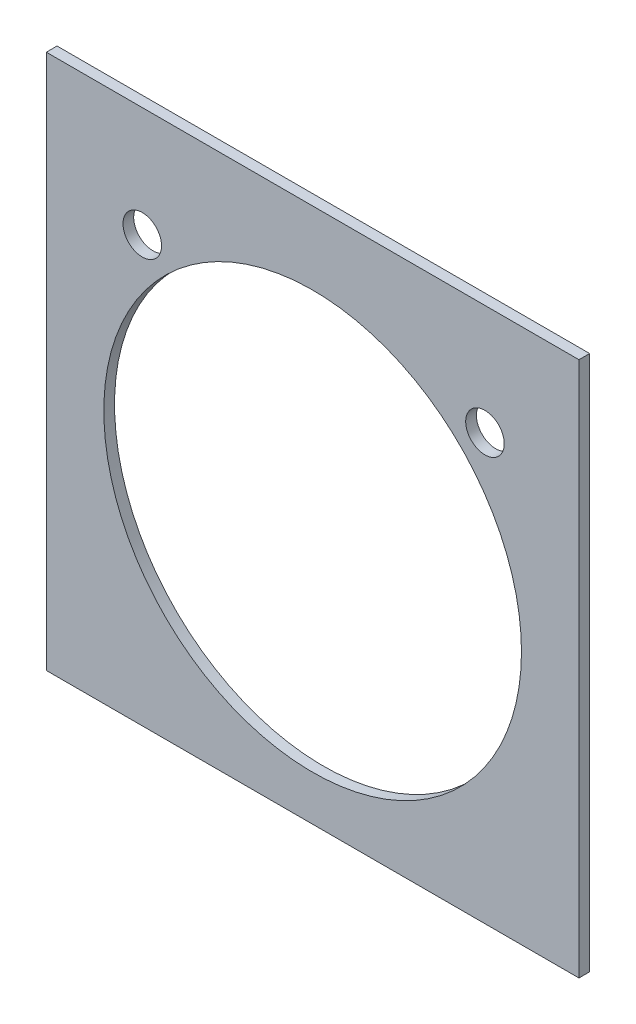
ISO-10303-21;
HEADER;
FILE_DESCRIPTION(('STEP AP214'),'2;1');
FILE_NAME('part.step','',(''),(''),'','','');
FILE_SCHEMA(('AUTOMOTIVE_DESIGN { 1 0 10303 214 1 1 1 1 }'));
ENDSEC;
DATA;
#1=APPLICATION_CONTEXT('core data for automotive mechanical design processes');
#2=APPLICATION_PROTOCOL_DEFINITION('international standard','automotive_design',2000,#1);
#3=PRODUCT_CONTEXT('',#1,'mechanical');
#4=PRODUCT('Part','Part','',(#3));
#5=PRODUCT_RELATED_PRODUCT_CATEGORY('part','',(#4));
#6=PRODUCT_DEFINITION_FORMATION('','',#4);
#7=PRODUCT_DEFINITION_CONTEXT('part definition',#1,'design');
#8=PRODUCT_DEFINITION('design','',#6,#7);
#9=PRODUCT_DEFINITION_SHAPE('','',#8);
#10=(LENGTH_UNIT() NAMED_UNIT(*) SI_UNIT(.MILLI.,.METRE.));
#11=(NAMED_UNIT(*) PLANE_ANGLE_UNIT() SI_UNIT($,.RADIAN.));
#12=(NAMED_UNIT(*) SI_UNIT($,.STERADIAN.) SOLID_ANGLE_UNIT());
#13=UNCERTAINTY_MEASURE_WITH_UNIT(LENGTH_MEASURE(1.E-05),#10,'distance_accuracy_value','');
#14=(GEOMETRIC_REPRESENTATION_CONTEXT(3) GLOBAL_UNCERTAINTY_ASSIGNED_CONTEXT((#13)) GLOBAL_UNIT_ASSIGNED_CONTEXT((#10,
#11,#12)) REPRESENTATION_CONTEXT('',''));
#15=CARTESIAN_POINT('',(0.,0.,0.));
#16=DIRECTION('',(0.,0.,1.));
#17=DIRECTION('',(1.,0.,0.));
#18=AXIS2_PLACEMENT_3D('',#15,#16,#17);
#19=CARTESIAN_POINT('',(24.8681898066784,25.,1.));
#20=DIRECTION('',(-1.,0.,0.));
#21=DIRECTION('',(0.,0.,1.));
#22=AXIS2_PLACEMENT_3D('',#19,#20,#21);
#23=PLANE('',#22);
#24=DIRECTION('',(0.,1.,0.));
#25=VECTOR('',#24,1.);
#26=CARTESIAN_POINT('',(24.8681898066784,25.,0.));
#27=LINE('',#26,#25);
#28=CARTESIAN_POINT('',(24.8681898066784,-25.,0.));
#29=VERTEX_POINT('',#28);
#30=CARTESIAN_POINT('',(24.8681898066784,25.,0.));
#31=VERTEX_POINT('',#30);
#32=EDGE_CURVE('E110',#29,#31,#27,.T.);
#33=ORIENTED_EDGE('',*,*,#32,.T.);
#34=DIRECTION('',(0.,0.,-1.));
#35=VECTOR('',#34,1.);
#36=CARTESIAN_POINT('',(24.8681898066784,25.,1.));
#37=LINE('',#36,#35);
#38=CARTESIAN_POINT('',(24.8681898066784,25.,1.));
#39=VERTEX_POINT('',#38);
#40=EDGE_CURVE('E11',#39,#31,#37,.T.);
#41=ORIENTED_EDGE('',*,*,#40,.F.);
#42=DIRECTION('',(0.,1.,0.));
#43=VECTOR('',#42,1.);
#44=CARTESIAN_POINT('',(24.8681898066784,25.,1.));
#45=LINE('',#44,#43);
#46=CARTESIAN_POINT('',(24.8681898066784,-25.,1.));
#47=VERTEX_POINT('',#46);
#48=EDGE_CURVE('E94',#47,#39,#45,.T.);
#49=ORIENTED_EDGE('',*,*,#48,.F.);
#50=DIRECTION('',(0.,0.,-1.));
#51=VECTOR('',#50,1.);
#52=CARTESIAN_POINT('',(24.8681898066784,-25.,1.));
#53=LINE('',#52,#51);
#54=EDGE_CURVE('E106',#47,#29,#53,.T.);
#55=ORIENTED_EDGE('',*,*,#54,.T.);
#56=EDGE_LOOP('',(#33,#41,#49,#55));
#57=FACE_BOUND('',#56,.T.);
#58=ADVANCED_FACE('F42',(#57),#23,.F.);
#59=CARTESIAN_POINT('',(-24.8681898066784,25.,1.));
#60=DIRECTION('',(0.,-1.,0.));
#61=DIRECTION('',(0.,0.,-1.));
#62=AXIS2_PLACEMENT_3D('',#59,#60,#61);
#63=PLANE('',#62);
#64=DIRECTION('',(-1.,0.,0.));
#65=VECTOR('',#64,1.);
#66=CARTESIAN_POINT('',(-24.8681898066784,25.,0.));
#67=LINE('',#66,#65);
#68=CARTESIAN_POINT('',(-24.8681898066784,25.,0.));
#69=VERTEX_POINT('',#68);
#70=EDGE_CURVE('E99',#31,#69,#67,.T.);
#71=ORIENTED_EDGE('',*,*,#70,.T.);
#72=DIRECTION('',(0.,0.,-1.));
#73=VECTOR('',#72,1.);
#74=CARTESIAN_POINT('',(-24.8681898066784,25.,1.));
#75=LINE('',#74,#73);
#76=CARTESIAN_POINT('',(-24.8681898066784,25.,1.));
#77=VERTEX_POINT('',#76);
#78=EDGE_CURVE('E51',#77,#69,#75,.T.);
#79=ORIENTED_EDGE('',*,*,#78,.F.);
#80=DIRECTION('',(-1.,0.,0.));
#81=VECTOR('',#80,1.);
#82=CARTESIAN_POINT('',(-24.8681898066784,25.,1.));
#83=LINE('',#82,#81);
#84=EDGE_CURVE('E89',#39,#77,#83,.T.);
#85=ORIENTED_EDGE('',*,*,#84,.F.);
#86=ORIENTED_EDGE('',*,*,#40,.T.);
#87=EDGE_LOOP('',(#71,#79,#85,#86));
#88=FACE_BOUND('',#87,.T.);
#89=ADVANCED_FACE('F98',(#88),#63,.F.);
#90=CARTESIAN_POINT('',(-24.8681898066784,25.,1.));
#91=DIRECTION('',(1.,0.,0.));
#92=DIRECTION('',(0.,0.,-1.));
#93=AXIS2_PLACEMENT_3D('',#90,#91,#92);
#94=PLANE('',#93);
#95=DIRECTION('',(0.,-1.,0.));
#96=VECTOR('',#95,1.);
#97=CARTESIAN_POINT('',(-24.8681898066784,25.,0.));
#98=LINE('',#97,#96);
#99=CARTESIAN_POINT('',(-24.8681898066784,-25.,0.));
#100=VERTEX_POINT('',#99);
#101=EDGE_CURVE('E76',#69,#100,#98,.T.);
#102=ORIENTED_EDGE('',*,*,#101,.T.);
#103=DIRECTION('',(0.,0.,-1.));
#104=VECTOR('',#103,1.);
#105=CARTESIAN_POINT('',(-24.8681898066784,-25.,1.));
#106=LINE('',#105,#104);
#107=CARTESIAN_POINT('',(-24.8681898066784,-25.,1.));
#108=VERTEX_POINT('',#107);
#109=EDGE_CURVE('E101',#108,#100,#106,.T.);
#110=ORIENTED_EDGE('',*,*,#109,.F.);
#111=DIRECTION('',(0.,-1.,0.));
#112=VECTOR('',#111,1.);
#113=CARTESIAN_POINT('',(-24.8681898066784,25.,1.));
#114=LINE('',#113,#112);
#115=EDGE_CURVE('E92',#77,#108,#114,.T.);
#116=ORIENTED_EDGE('',*,*,#115,.F.);
#117=ORIENTED_EDGE('',*,*,#78,.T.);
#118=EDGE_LOOP('',(#102,#110,#116,#117));
#119=FACE_BOUND('',#118,.T.);
#120=ADVANCED_FACE('F102',(#119),#94,.F.);
#121=CARTESIAN_POINT('',(-24.8681898066784,-25.,1.));
#122=DIRECTION('',(0.,1.,0.));
#123=DIRECTION('',(0.,0.,1.));
#124=AXIS2_PLACEMENT_3D('',#121,#122,#123);
#125=PLANE('',#124);
#126=DIRECTION('',(1.,0.,0.));
#127=VECTOR('',#126,1.);
#128=CARTESIAN_POINT('',(-24.8681898066784,-25.,0.));
#129=LINE('',#128,#127);
#130=EDGE_CURVE('E82',#100,#29,#129,.T.);
#131=ORIENTED_EDGE('',*,*,#130,.T.);
#132=ORIENTED_EDGE('',*,*,#54,.F.);
#133=DIRECTION('',(1.,0.,0.));
#134=VECTOR('',#133,1.);
#135=CARTESIAN_POINT('',(-24.8681898066784,-25.,1.));
#136=LINE('',#135,#134);
#137=EDGE_CURVE('E59',#108,#47,#136,.T.);
#138=ORIENTED_EDGE('',*,*,#137,.F.);
#139=ORIENTED_EDGE('',*,*,#109,.T.);
#140=EDGE_LOOP('',(#131,#132,#138,#139));
#141=FACE_BOUND('',#140,.T.);
#142=ADVANCED_FACE('F124',(#141),#125,.F.);
#143=CARTESIAN_POINT('',(0.,0.,1.));
#144=DIRECTION('',(0.,0.,1.));
#145=DIRECTION('',(1.,0.,0.));
#146=AXIS2_PLACEMENT_3D('',#143,#144,#145);
#147=PLANE('',#146);
#148=CARTESIAN_POINT('',(-15.9089922983916,14.7141109025896,1.));
#149=DIRECTION('',(0.,0.,1.));
#150=DIRECTION('',(1.,0.,0.));
#151=AXIS2_PLACEMENT_3D('',#148,#149,#150);
#152=CIRCLE('',#151,1.8);
#153=CARTESIAN_POINT('',(-14.1089922983916,14.7141109025896,1.));
#154=VERTEX_POINT('',#153);
#155=EDGE_CURVE('E147',#154,#154,#152,.T.);
#156=ORIENTED_EDGE('',*,*,#155,.F.);
#157=EDGE_LOOP('',(#156));
#158=FACE_BOUND('',#157,.T.);
#159=CARTESIAN_POINT('',(16.0910077016084,14.7141109025896,1.));
#160=DIRECTION('',(0.,0.,1.));
#161=DIRECTION('',(1.,0.,0.));
#162=AXIS2_PLACEMENT_3D('',#159,#160,#161);
#163=CIRCLE('',#162,1.8);
#164=CARTESIAN_POINT('',(17.8910077016084,14.7141109025896,1.));
#165=VERTEX_POINT('',#164);
#166=EDGE_CURVE('E143',#165,#165,#163,.T.);
#167=ORIENTED_EDGE('',*,*,#166,.F.);
#168=EDGE_LOOP('',(#167));
#169=FACE_BOUND('',#168,.T.);
#170=CARTESIAN_POINT('',(0.,-1.3,1.));
#171=DIRECTION('',(0.,0.,1.));
#172=DIRECTION('',(1.,0.,0.));
#173=AXIS2_PLACEMENT_3D('',#170,#171,#172);
#174=CIRCLE('',#173,19.5);
#175=CARTESIAN_POINT('',(19.5,-1.3,1.));
#176=VERTEX_POINT('',#175);
#177=EDGE_CURVE('E131',#176,#176,#174,.T.);
#178=ORIENTED_EDGE('',*,*,#177,.F.);
#179=EDGE_LOOP('',(#178));
#180=FACE_BOUND('',#179,.T.);
#181=ORIENTED_EDGE('',*,*,#48,.T.);
#182=ORIENTED_EDGE('',*,*,#84,.T.);
#183=ORIENTED_EDGE('',*,*,#115,.T.);
#184=ORIENTED_EDGE('',*,*,#137,.T.);
#185=EDGE_LOOP('',(#181,#182,#183,#184));
#186=FACE_BOUND('',#185,.T.);
#187=ADVANCED_FACE('F90',(#158,#169,#180,#186),#147,.T.);
#188=CARTESIAN_POINT('',(0.,0.,0.));
#189=DIRECTION('',(0.,0.,1.));
#190=DIRECTION('',(1.,0.,0.));
#191=AXIS2_PLACEMENT_3D('',#188,#189,#190);
#192=PLANE('',#191);
#193=CARTESIAN_POINT('',(-15.9089922983916,14.7141109025896,0.));
#194=DIRECTION('',(0.,0.,1.));
#195=DIRECTION('',(1.,0.,0.));
#196=AXIS2_PLACEMENT_3D('',#193,#194,#195);
#197=CIRCLE('',#196,1.8);
#198=CARTESIAN_POINT('',(-14.1089922983916,14.7141109025896,0.));
#199=VERTEX_POINT('',#198);
#200=EDGE_CURVE('E135',#199,#199,#197,.T.);
#201=ORIENTED_EDGE('',*,*,#200,.T.);
#202=EDGE_LOOP('',(#201));
#203=FACE_BOUND('',#202,.T.);
#204=CARTESIAN_POINT('',(16.0910077016084,14.7141109025896,0.));
#205=DIRECTION('',(0.,0.,1.));
#206=DIRECTION('',(1.,0.,0.));
#207=AXIS2_PLACEMENT_3D('',#204,#205,#206);
#208=CIRCLE('',#207,1.8);
#209=CARTESIAN_POINT('',(17.8910077016084,14.7141109025896,0.));
#210=VERTEX_POINT('',#209);
#211=EDGE_CURVE('E139',#210,#210,#208,.T.);
#212=ORIENTED_EDGE('',*,*,#211,.T.);
#213=EDGE_LOOP('',(#212));
#214=FACE_BOUND('',#213,.T.);
#215=CARTESIAN_POINT('',(0.,-1.3,0.));
#216=DIRECTION('',(0.,0.,1.));
#217=DIRECTION('',(1.,0.,0.));
#218=AXIS2_PLACEMENT_3D('',#215,#216,#217);
#219=CIRCLE('',#218,19.5);
#220=CARTESIAN_POINT('',(19.5,-1.3,0.));
#221=VERTEX_POINT('',#220);
#222=EDGE_CURVE('E114',#221,#221,#219,.T.);
#223=ORIENTED_EDGE('',*,*,#222,.T.);
#224=EDGE_LOOP('',(#223));
#225=FACE_BOUND('',#224,.T.);
#226=ORIENTED_EDGE('',*,*,#32,.F.);
#227=ORIENTED_EDGE('',*,*,#130,.F.);
#228=ORIENTED_EDGE('',*,*,#101,.F.);
#229=ORIENTED_EDGE('',*,*,#70,.F.);
#230=EDGE_LOOP('',(#226,#227,#228,#229));
#231=FACE_BOUND('',#230,.T.);
#232=ADVANCED_FACE('F127',(#203,#214,#225,#231),#192,.F.);
#233=CARTESIAN_POINT('',(0.,-1.3,0.));
#234=DIRECTION('',(0.,0.,1.));
#235=DIRECTION('',(1.,0.,0.));
#236=AXIS2_PLACEMENT_3D('',#233,#234,#235);
#237=CYLINDRICAL_SURFACE('',#236,19.5);
#238=ORIENTED_EDGE('',*,*,#222,.F.);
#239=EDGE_LOOP('',(#238));
#240=FACE_BOUND('',#239,.T.);
#241=ORIENTED_EDGE('',*,*,#177,.T.);
#242=EDGE_LOOP('',(#241));
#243=FACE_BOUND('',#242,.T.);
#244=ADVANCED_FACE('F171',(#240,#243),#237,.F.);
#245=CARTESIAN_POINT('',(16.0910077016084,14.7141109025896,0.));
#246=DIRECTION('',(0.,0.,1.));
#247=DIRECTION('',(1.,0.,0.));
#248=AXIS2_PLACEMENT_3D('',#245,#246,#247);
#249=CYLINDRICAL_SURFACE('',#248,1.8);
#250=ORIENTED_EDGE('',*,*,#211,.F.);
#251=EDGE_LOOP('',(#250));
#252=FACE_BOUND('',#251,.T.);
#253=ORIENTED_EDGE('',*,*,#166,.T.);
#254=EDGE_LOOP('',(#253));
#255=FACE_BOUND('',#254,.T.);
#256=ADVANCED_FACE('F160',(#252,#255),#249,.F.);
#257=CARTESIAN_POINT('',(-15.9089922983916,14.7141109025896,0.));
#258=DIRECTION('',(0.,0.,1.));
#259=DIRECTION('',(1.,0.,0.));
#260=AXIS2_PLACEMENT_3D('',#257,#258,#259);
#261=CYLINDRICAL_SURFACE('',#260,1.8);
#262=ORIENTED_EDGE('',*,*,#200,.F.);
#263=EDGE_LOOP('',(#262));
#264=FACE_BOUND('',#263,.T.);
#265=ORIENTED_EDGE('',*,*,#155,.T.);
#266=EDGE_LOOP('',(#265));
#267=FACE_BOUND('',#266,.T.);
#268=ADVANCED_FACE('F157',(#264,#267),#261,.F.);
#269=CLOSED_SHELL('',(#58,#89,#120,#142,#187,#232,#244,#256,#268));
#270=MANIFOLD_SOLID_BREP('B2',#269);
#271=ADVANCED_BREP_SHAPE_REPRESENTATION('',(#18,#270),#14);
#272=SHAPE_DEFINITION_REPRESENTATION(#9,#271);
ENDSEC;
END-ISO-10303-21;
